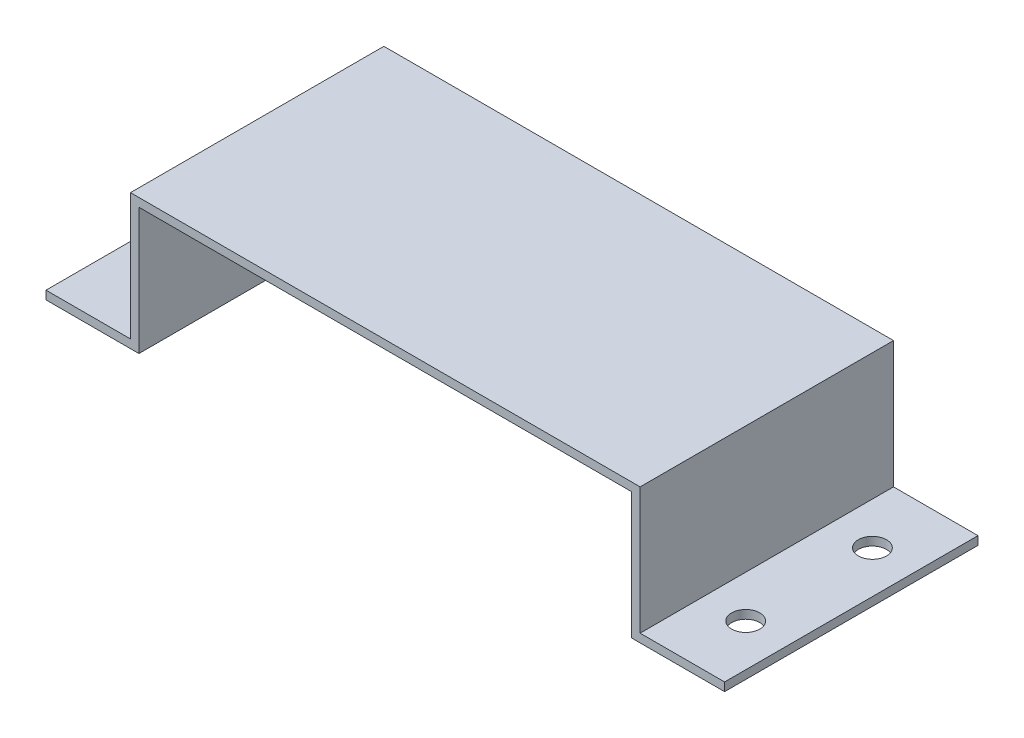
ISO-10303-21;
HEADER;
FILE_DESCRIPTION(('STEP AP214'),'2;1');
FILE_NAME('part.step','',(''),(''),'','','');
FILE_SCHEMA(('AUTOMOTIVE_DESIGN { 1 0 10303 214 1 1 1 1 }'));
ENDSEC;
DATA;
#1=APPLICATION_CONTEXT('core data for automotive mechanical design processes');
#2=APPLICATION_PROTOCOL_DEFINITION('international standard','automotive_design',2000,#1);
#3=PRODUCT_CONTEXT('',#1,'mechanical');
#4=PRODUCT('Part','Part','',(#3));
#5=PRODUCT_RELATED_PRODUCT_CATEGORY('part','',(#4));
#6=PRODUCT_DEFINITION_FORMATION('','',#4);
#7=PRODUCT_DEFINITION_CONTEXT('part definition',#1,'design');
#8=PRODUCT_DEFINITION('design','',#6,#7);
#9=PRODUCT_DEFINITION_SHAPE('','',#8);
#10=(LENGTH_UNIT() NAMED_UNIT(*) SI_UNIT(.MILLI.,.METRE.));
#11=(NAMED_UNIT(*) PLANE_ANGLE_UNIT() SI_UNIT($,.RADIAN.));
#12=(NAMED_UNIT(*) SI_UNIT($,.STERADIAN.) SOLID_ANGLE_UNIT());
#13=UNCERTAINTY_MEASURE_WITH_UNIT(LENGTH_MEASURE(1.E-05),#10,'distance_accuracy_value','');
#14=(GEOMETRIC_REPRESENTATION_CONTEXT(3) GLOBAL_UNCERTAINTY_ASSIGNED_CONTEXT((#13)) GLOBAL_UNIT_ASSIGNED_CONTEXT((#10,
#11,#12)) REPRESENTATION_CONTEXT('',''));
#15=CARTESIAN_POINT('',(0.,0.,0.));
#16=DIRECTION('',(0.,0.,1.));
#17=DIRECTION('',(1.,0.,0.));
#18=AXIS2_PLACEMENT_3D('',#15,#16,#17);
#19=CARTESIAN_POINT('',(159.03265048703,-21.5756520842586,90.));
#20=DIRECTION('',(0.,1.,0.));
#21=DIRECTION('',(0.,0.,1.));
#22=AXIS2_PLACEMENT_3D('',#19,#20,#21);
#23=PLANE('',#22);
#24=CARTESIAN_POINT('',(144.03265048703,-21.5756520842586,22.5));
#25=DIRECTION('',(0.,1.,0.));
#26=DIRECTION('',(0.,0.,1.));
#27=AXIS2_PLACEMENT_3D('',#24,#25,#26);
#28=CIRCLE('',#27,4.99999999999999);
#29=CARTESIAN_POINT('',(144.03265048703,-21.5756520842586,27.5));
#30=VERTEX_POINT('',#29);
#31=EDGE_CURVE('E216',#30,#30,#28,.T.);
#32=ORIENTED_EDGE('',*,*,#31,.T.);
#33=EDGE_LOOP('',(#32));
#34=FACE_BOUND('',#33,.T.);
#35=DIRECTION('',(1.,0.,0.));
#36=VECTOR('',#35,1.);
#37=CARTESIAN_POINT('',(159.03265048703,-21.5756520842586,0.));
#38=LINE('',#37,#36);
#39=CARTESIAN_POINT('',(126.03265048703,-21.5756520842586,0.));
#40=VERTEX_POINT('',#39);
#41=CARTESIAN_POINT('',(159.03265048703,-21.5756520842586,0.));
#42=VERTEX_POINT('',#41);
#43=EDGE_CURVE('E171',#40,#42,#38,.T.);
#44=ORIENTED_EDGE('',*,*,#43,.T.);
#45=DIRECTION('',(0.,0.,-1.));
#46=VECTOR('',#45,1.);
#47=CARTESIAN_POINT('',(159.03265048703,-21.5756520842586,90.));
#48=LINE('',#47,#46);
#49=CARTESIAN_POINT('',(159.03265048703,-21.5756520842586,90.));
#50=VERTEX_POINT('',#49);
#51=EDGE_CURVE('E203',#50,#42,#48,.T.);
#52=ORIENTED_EDGE('',*,*,#51,.F.);
#53=DIRECTION('',(1.,0.,0.));
#54=VECTOR('',#53,1.);
#55=CARTESIAN_POINT('',(126.03265048703,-21.5756520842586,90.));
#56=LINE('',#55,#54);
#57=CARTESIAN_POINT('',(126.03265048703,-21.5756520842586,90.));
#58=VERTEX_POINT('',#57);
#59=EDGE_CURVE('E237',#58,#50,#56,.T.);
#60=ORIENTED_EDGE('',*,*,#59,.F.);
#61=DIRECTION('',(0.,0.,-1.));
#62=VECTOR('',#61,1.);
#63=CARTESIAN_POINT('',(126.03265048703,-21.5756520842586,90.));
#64=LINE('',#63,#62);
#65=EDGE_CURVE('E206',#58,#40,#64,.T.);
#66=ORIENTED_EDGE('',*,*,#65,.T.);
#67=EDGE_LOOP('',(#44,#52,#60,#66));
#68=FACE_BOUND('',#67,.T.);
#69=CARTESIAN_POINT('',(144.03265048703,-21.5756520842586,67.5));
#70=DIRECTION('',(0.,1.,0.));
#71=DIRECTION('',(0.,0.,1.));
#72=AXIS2_PLACEMENT_3D('',#69,#70,#71);
#73=CIRCLE('',#72,4.99999999999999);
#74=CARTESIAN_POINT('',(144.03265048703,-21.5756520842586,72.5));
#75=VERTEX_POINT('',#74);
#76=EDGE_CURVE('E166',#75,#75,#73,.F.);
#77=ORIENTED_EDGE('',*,*,#76,.F.);
#78=EDGE_LOOP('',(#77));
#79=FACE_BOUND('',#78,.T.);
#80=ADVANCED_FACE('F37',(#34,#68,#79),#23,.F.);
#81=CARTESIAN_POINT('',(129.03265048703,-18.5756520842586,90.));
#82=DIRECTION('',(0.,-1.,0.));
#83=DIRECTION('',(0.,0.,-1.));
#84=AXIS2_PLACEMENT_3D('',#81,#82,#83);
#85=PLANE('',#84);
#86=CARTESIAN_POINT('',(144.03265048703,-18.5756520842586,22.5));
#87=DIRECTION('',(0.,1.,0.));
#88=DIRECTION('',(0.,0.,1.));
#89=AXIS2_PLACEMENT_3D('',#86,#87,#88);
#90=CIRCLE('',#89,4.99999999999999);
#91=CARTESIAN_POINT('',(144.03265048703,-18.5756520842586,27.5));
#92=VERTEX_POINT('',#91);
#93=EDGE_CURVE('E212',#92,#92,#90,.T.);
#94=ORIENTED_EDGE('',*,*,#93,.F.);
#95=EDGE_LOOP('',(#94));
#96=FACE_BOUND('',#95,.T.);
#97=DIRECTION('',(-1.,0.,0.));
#98=VECTOR('',#97,1.);
#99=CARTESIAN_POINT('',(129.03265048703,-18.5756520842586,0.));
#100=LINE('',#99,#98);
#101=CARTESIAN_POINT('',(159.03265048703,-18.5756520842586,0.));
#102=VERTEX_POINT('',#101);
#103=CARTESIAN_POINT('',(129.03265048703,-18.5756520842586,0.));
#104=VERTEX_POINT('',#103);
#105=EDGE_CURVE('E175',#102,#104,#100,.T.);
#106=ORIENTED_EDGE('',*,*,#105,.T.);
#107=DIRECTION('',(0.,0.,-1.));
#108=VECTOR('',#107,1.);
#109=CARTESIAN_POINT('',(129.03265048703,-18.5756520842586,90.));
#110=LINE('',#109,#108);
#111=CARTESIAN_POINT('',(129.03265048703,-18.5756520842586,90.));
#112=VERTEX_POINT('',#111);
#113=EDGE_CURVE('E197',#112,#104,#110,.T.);
#114=ORIENTED_EDGE('',*,*,#113,.F.);
#115=DIRECTION('',(-1.,0.,0.));
#116=VECTOR('',#115,1.);
#117=CARTESIAN_POINT('',(129.03265048703,-18.5756520842586,90.));
#118=LINE('',#117,#116);
#119=CARTESIAN_POINT('',(159.03265048703,-18.5756520842586,90.));
#120=VERTEX_POINT('',#119);
#121=EDGE_CURVE('E241',#120,#112,#118,.T.);
#122=ORIENTED_EDGE('',*,*,#121,.F.);
#123=DIRECTION('',(0.,0.,-1.));
#124=VECTOR('',#123,1.);
#125=CARTESIAN_POINT('',(159.03265048703,-18.5756520842586,90.));
#126=LINE('',#125,#124);
#127=EDGE_CURVE('E200',#120,#102,#126,.T.);
#128=ORIENTED_EDGE('',*,*,#127,.T.);
#129=EDGE_LOOP('',(#106,#114,#122,#128));
#130=FACE_BOUND('',#129,.T.);
#131=CARTESIAN_POINT('',(144.03265048703,-18.5756520842586,67.5));
#132=DIRECTION('',(0.,1.,0.));
#133=DIRECTION('',(0.,0.,1.));
#134=AXIS2_PLACEMENT_3D('',#131,#132,#133);
#135=CIRCLE('',#134,4.99999999999999);
#136=CARTESIAN_POINT('',(144.03265048703,-18.5756520842586,72.5));
#137=VERTEX_POINT('',#136);
#138=EDGE_CURVE('E218',#137,#137,#135,.F.);
#139=ORIENTED_EDGE('',*,*,#138,.T.);
#140=EDGE_LOOP('',(#139));
#141=FACE_BOUND('',#140,.T.);
#142=ADVANCED_FACE('F281',(#96,#130,#141),#85,.F.);
#143=CARTESIAN_POINT('',(-51.9673495129696,-18.5756520842586,90.));
#144=DIRECTION('',(0.,-1.,0.));
#145=DIRECTION('',(1.,0.,0.));
#146=AXIS2_PLACEMENT_3D('',#143,#144,#145);
#147=PLANE('',#146);
#148=CARTESIAN_POINT('',(-66.9673495129696,-18.5756520842586,67.5));
#149=DIRECTION('',(0.,1.,0.));
#150=DIRECTION('',(0.,0.,1.));
#151=AXIS2_PLACEMENT_3D('',#148,#149,#150);
#152=CIRCLE('',#151,4.99999999999999);
#153=CARTESIAN_POINT('',(-66.9673495129696,-18.5756520842586,72.5));
#154=VERTEX_POINT('',#153);
#155=EDGE_CURVE('E223',#154,#154,#152,.T.);
#156=ORIENTED_EDGE('',*,*,#155,.F.);
#157=EDGE_LOOP('',(#156));
#158=FACE_BOUND('',#157,.T.);
#159=DIRECTION('',(-1.,0.,0.));
#160=VECTOR('',#159,1.);
#161=CARTESIAN_POINT('',(-51.9673495129696,-18.5756520842586,0.));
#162=LINE('',#161,#160);
#163=CARTESIAN_POINT('',(-51.9673495129696,-18.5756520842586,0.));
#164=VERTEX_POINT('',#163);
#165=CARTESIAN_POINT('',(-81.9673495129696,-18.5756520842586,0.));
#166=VERTEX_POINT('',#165);
#167=EDGE_CURVE('E151',#164,#166,#162,.T.);
#168=ORIENTED_EDGE('',*,*,#167,.T.);
#169=DIRECTION('',(0.,0.,-1.));
#170=VECTOR('',#169,1.);
#171=CARTESIAN_POINT('',(-81.9673495129696,-18.5756520842586,90.));
#172=LINE('',#171,#170);
#173=CARTESIAN_POINT('',(-81.9673495129696,-18.5756520842586,90.));
#174=VERTEX_POINT('',#173);
#175=EDGE_CURVE('E147',#174,#166,#172,.T.);
#176=ORIENTED_EDGE('',*,*,#175,.F.);
#177=DIRECTION('',(-1.,0.,0.));
#178=VECTOR('',#177,1.);
#179=CARTESIAN_POINT('',(-51.9673495129696,-18.5756520842586,90.));
#180=LINE('',#179,#178);
#181=CARTESIAN_POINT('',(-51.9673495129696,-18.5756520842586,90.));
#182=VERTEX_POINT('',#181);
#183=EDGE_CURVE('E134',#182,#174,#180,.T.);
#184=ORIENTED_EDGE('',*,*,#183,.F.);
#185=DIRECTION('',(0.,0.,-1.));
#186=VECTOR('',#185,1.);
#187=CARTESIAN_POINT('',(-51.9673495129696,-18.5756520842586,90.));
#188=LINE('',#187,#186);
#189=EDGE_CURVE('E153',#182,#164,#188,.T.);
#190=ORIENTED_EDGE('',*,*,#189,.T.);
#191=EDGE_LOOP('',(#168,#176,#184,#190));
#192=FACE_BOUND('',#191,.T.);
#193=CARTESIAN_POINT('',(-66.9673495129696,-18.5756520842586,22.5));
#194=DIRECTION('',(0.,1.,0.));
#195=DIRECTION('',(0.,0.,1.));
#196=AXIS2_PLACEMENT_3D('',#193,#194,#195);
#197=CIRCLE('',#196,4.99999999999999);
#198=CARTESIAN_POINT('',(-66.9673495129696,-18.5756520842586,27.5));
#199=VERTEX_POINT('',#198);
#200=EDGE_CURVE('E227',#199,#199,#197,.F.);
#201=ORIENTED_EDGE('',*,*,#200,.T.);
#202=EDGE_LOOP('',(#201));
#203=FACE_BOUND('',#202,.T.);
#204=ADVANCED_FACE('F148',(#158,#192,#203),#147,.F.);
#205=CARTESIAN_POINT('',(-48.9673495129696,-21.5756520842586,90.));
#206=DIRECTION('',(0.,1.,0.));
#207=DIRECTION('',(0.,0.,1.));
#208=AXIS2_PLACEMENT_3D('',#205,#206,#207);
#209=PLANE('',#208);
#210=CARTESIAN_POINT('',(-66.9673495129696,-21.5756520842586,67.5));
#211=DIRECTION('',(0.,1.,0.));
#212=DIRECTION('',(0.,0.,1.));
#213=AXIS2_PLACEMENT_3D('',#210,#211,#212);
#214=CIRCLE('',#213,4.99999999999999);
#215=CARTESIAN_POINT('',(-66.9673495129696,-21.5756520842586,72.5));
#216=VERTEX_POINT('',#215);
#217=EDGE_CURVE('E210',#216,#216,#214,.T.);
#218=ORIENTED_EDGE('',*,*,#217,.T.);
#219=EDGE_LOOP('',(#218));
#220=FACE_BOUND('',#219,.T.);
#221=DIRECTION('',(1.,0.,0.));
#222=VECTOR('',#221,1.);
#223=CARTESIAN_POINT('',(-48.9673495129696,-21.5756520842586,0.));
#224=LINE('',#223,#222);
#225=CARTESIAN_POINT('',(-81.9673495129696,-21.5756520842586,0.));
#226=VERTEX_POINT('',#225);
#227=CARTESIAN_POINT('',(-48.9673495129696,-21.5756520842586,0.));
#228=VERTEX_POINT('',#227);
#229=EDGE_CURVE('E97',#226,#228,#224,.T.);
#230=ORIENTED_EDGE('',*,*,#229,.T.);
#231=DIRECTION('',(0.,0.,-1.));
#232=VECTOR('',#231,1.);
#233=CARTESIAN_POINT('',(-48.9673495129696,-21.5756520842586,90.));
#234=LINE('',#233,#232);
#235=CARTESIAN_POINT('',(-48.9673495129696,-21.5756520842586,90.));
#236=VERTEX_POINT('',#235);
#237=EDGE_CURVE('E158',#236,#228,#234,.T.);
#238=ORIENTED_EDGE('',*,*,#237,.F.);
#239=DIRECTION('',(1.,0.,0.));
#240=VECTOR('',#239,1.);
#241=CARTESIAN_POINT('',(-81.9673495129696,-21.5756520842586,90.));
#242=LINE('',#241,#240);
#243=CARTESIAN_POINT('',(-81.9673495129696,-21.5756520842586,90.));
#244=VERTEX_POINT('',#243);
#245=EDGE_CURVE('E56',#244,#236,#242,.T.);
#246=ORIENTED_EDGE('',*,*,#245,.F.);
#247=DIRECTION('',(0.,0.,-1.));
#248=VECTOR('',#247,1.);
#249=CARTESIAN_POINT('',(-81.9673495129696,-21.5756520842586,90.));
#250=LINE('',#249,#248);
#251=EDGE_CURVE('E154',#244,#226,#250,.T.);
#252=ORIENTED_EDGE('',*,*,#251,.T.);
#253=EDGE_LOOP('',(#230,#238,#246,#252));
#254=FACE_BOUND('',#253,.T.);
#255=CARTESIAN_POINT('',(-66.9673495129696,-21.5756520842586,22.5));
#256=DIRECTION('',(0.,1.,0.));
#257=DIRECTION('',(0.,0.,1.));
#258=AXIS2_PLACEMENT_3D('',#255,#256,#257);
#259=CIRCLE('',#258,4.99999999999999);
#260=CARTESIAN_POINT('',(-66.9673495129696,-21.5756520842586,27.5));
#261=VERTEX_POINT('',#260);
#262=EDGE_CURVE('E41',#261,#261,#259,.F.);
#263=ORIENTED_EDGE('',*,*,#262,.F.);
#264=EDGE_LOOP('',(#263));
#265=FACE_BOUND('',#264,.T.);
#266=ADVANCED_FACE('F257',(#220,#254,#265),#209,.F.);
#267=CARTESIAN_POINT('',(-48.9673495129696,23.4243479157414,90.));
#268=DIRECTION('',(-1.,0.,0.));
#269=DIRECTION('',(0.,-1.,0.));
#270=AXIS2_PLACEMENT_3D('',#267,#268,#269);
#271=PLANE('',#270);
#272=DIRECTION('',(0.,1.,0.));
#273=VECTOR('',#272,1.);
#274=CARTESIAN_POINT('',(-48.9673495129696,23.4243479157414,0.));
#275=LINE('',#274,#273);
#276=CARTESIAN_POINT('',(-48.9673495129696,23.4243479157414,0.));
#277=VERTEX_POINT('',#276);
#278=EDGE_CURVE('E162',#228,#277,#275,.T.);
#279=ORIENTED_EDGE('',*,*,#278,.T.);
#280=DIRECTION('',(0.,0.,-1.));
#281=VECTOR('',#280,1.);
#282=CARTESIAN_POINT('',(-48.9673495129696,23.4243479157414,90.));
#283=LINE('',#282,#281);
#284=CARTESIAN_POINT('',(-48.9673495129696,23.4243479157414,90.));
#285=VERTEX_POINT('',#284);
#286=EDGE_CURVE('E11',#285,#277,#283,.T.);
#287=ORIENTED_EDGE('',*,*,#286,.F.);
#288=DIRECTION('',(0.,1.,0.));
#289=VECTOR('',#288,1.);
#290=CARTESIAN_POINT('',(-48.9673495129696,23.4243479157414,90.));
#291=LINE('',#290,#289);
#292=EDGE_CURVE('E187',#236,#285,#291,.T.);
#293=ORIENTED_EDGE('',*,*,#292,.F.);
#294=ORIENTED_EDGE('',*,*,#237,.T.);
#295=EDGE_LOOP('',(#279,#287,#293,#294));
#296=FACE_BOUND('',#295,.T.);
#297=ADVANCED_FACE('F39',(#296),#271,.F.);
#298=CARTESIAN_POINT('',(-48.9673495129696,23.4243479157414,90.));
#299=DIRECTION('',(0.,1.,0.));
#300=DIRECTION('',(0.,0.,1.));
#301=AXIS2_PLACEMENT_3D('',#298,#299,#300);
#302=PLANE('',#301);
#303=DIRECTION('',(1.,0.,0.));
#304=VECTOR('',#303,1.);
#305=CARTESIAN_POINT('',(-48.9673495129696,23.4243479157414,0.));
#306=LINE('',#305,#304);
#307=CARTESIAN_POINT('',(126.03265048703,23.4243479157414,0.));
#308=VERTEX_POINT('',#307);
#309=EDGE_CURVE('E165',#277,#308,#306,.T.);
#310=ORIENTED_EDGE('',*,*,#309,.T.);
#311=DIRECTION('',(0.,0.,-1.));
#312=VECTOR('',#311,1.);
#313=CARTESIAN_POINT('',(126.03265048703,23.4243479157414,90.));
#314=LINE('',#313,#312);
#315=CARTESIAN_POINT('',(126.03265048703,23.4243479157414,90.));
#316=VERTEX_POINT('',#315);
#317=EDGE_CURVE('E47',#316,#308,#314,.T.);
#318=ORIENTED_EDGE('',*,*,#317,.F.);
#319=DIRECTION('',(1.,0.,0.));
#320=VECTOR('',#319,1.);
#321=CARTESIAN_POINT('',(-48.9673495129696,23.4243479157414,90.));
#322=LINE('',#321,#320);
#323=EDGE_CURVE('E109',#285,#316,#322,.T.);
#324=ORIENTED_EDGE('',*,*,#323,.F.);
#325=ORIENTED_EDGE('',*,*,#286,.T.);
#326=EDGE_LOOP('',(#310,#318,#324,#325));
#327=FACE_BOUND('',#326,.T.);
#328=ADVANCED_FACE('F264',(#327),#302,.F.);
#329=CARTESIAN_POINT('',(126.03265048703,23.4243479157414,90.));
#330=DIRECTION('',(1.,0.,0.));
#331=DIRECTION('',(0.,0.,-1.));
#332=AXIS2_PLACEMENT_3D('',#329,#330,#331);
#333=PLANE('',#332);
#334=DIRECTION('',(0.,-1.,0.));
#335=VECTOR('',#334,1.);
#336=CARTESIAN_POINT('',(126.03265048703,23.4243479157414,0.));
#337=LINE('',#336,#335);
#338=EDGE_CURVE('E168',#308,#40,#337,.T.);
#339=ORIENTED_EDGE('',*,*,#338,.T.);
#340=ORIENTED_EDGE('',*,*,#65,.F.);
#341=DIRECTION('',(0.,-1.,0.));
#342=VECTOR('',#341,1.);
#343=CARTESIAN_POINT('',(126.03265048703,23.4243479157414,90.));
#344=LINE('',#343,#342);
#345=EDGE_CURVE('E235',#316,#58,#344,.T.);
#346=ORIENTED_EDGE('',*,*,#345,.F.);
#347=ORIENTED_EDGE('',*,*,#317,.T.);
#348=EDGE_LOOP('',(#339,#340,#346,#347));
#349=FACE_BOUND('',#348,.T.);
#350=ADVANCED_FACE('F267',(#349),#333,.F.);
#351=CARTESIAN_POINT('',(159.03265048703,-18.5756520842586,90.));
#352=DIRECTION('',(-1.,0.,0.));
#353=DIRECTION('',(0.,0.,1.));
#354=AXIS2_PLACEMENT_3D('',#351,#352,#353);
#355=PLANE('',#354);
#356=DIRECTION('',(0.,1.,0.));
#357=VECTOR('',#356,1.);
#358=CARTESIAN_POINT('',(159.03265048703,-18.5756520842586,0.));
#359=LINE('',#358,#357);
#360=EDGE_CURVE('E173',#42,#102,#359,.T.);
#361=ORIENTED_EDGE('',*,*,#360,.T.);
#362=ORIENTED_EDGE('',*,*,#127,.F.);
#363=DIRECTION('',(0.,1.,0.));
#364=VECTOR('',#363,1.);
#365=CARTESIAN_POINT('',(159.03265048703,-18.5756520842586,90.));
#366=LINE('',#365,#364);
#367=EDGE_CURVE('E239',#50,#120,#366,.T.);
#368=ORIENTED_EDGE('',*,*,#367,.F.);
#369=ORIENTED_EDGE('',*,*,#51,.T.);
#370=EDGE_LOOP('',(#361,#362,#368,#369));
#371=FACE_BOUND('',#370,.T.);
#372=ADVANCED_FACE('F277',(#371),#355,.F.);
#373=CARTESIAN_POINT('',(129.03265048703,26.4243479157414,90.));
#374=DIRECTION('',(-1.,0.,0.));
#375=DIRECTION('',(0.,0.,1.));
#376=AXIS2_PLACEMENT_3D('',#373,#374,#375);
#377=PLANE('',#376);
#378=DIRECTION('',(0.,1.,0.));
#379=VECTOR('',#378,1.);
#380=CARTESIAN_POINT('',(129.03265048703,26.4243479157414,0.));
#381=LINE('',#380,#379);
#382=CARTESIAN_POINT('',(129.03265048703,26.4243479157414,0.));
#383=VERTEX_POINT('',#382);
#384=EDGE_CURVE('E177',#104,#383,#381,.T.);
#385=ORIENTED_EDGE('',*,*,#384,.T.);
#386=DIRECTION('',(0.,0.,-1.));
#387=VECTOR('',#386,1.);
#388=CARTESIAN_POINT('',(129.03265048703,26.4243479157414,90.));
#389=LINE('',#388,#387);
#390=CARTESIAN_POINT('',(129.03265048703,26.4243479157414,90.));
#391=VERTEX_POINT('',#390);
#392=EDGE_CURVE('E194',#391,#383,#389,.T.);
#393=ORIENTED_EDGE('',*,*,#392,.F.);
#394=DIRECTION('',(0.,1.,0.));
#395=VECTOR('',#394,1.);
#396=CARTESIAN_POINT('',(129.03265048703,26.4243479157414,90.));
#397=LINE('',#396,#395);
#398=EDGE_CURVE('E243',#112,#391,#397,.T.);
#399=ORIENTED_EDGE('',*,*,#398,.F.);
#400=ORIENTED_EDGE('',*,*,#113,.T.);
#401=EDGE_LOOP('',(#385,#393,#399,#400));
#402=FACE_BOUND('',#401,.T.);
#403=ADVANCED_FACE('F285',(#402),#377,.F.);
#404=CARTESIAN_POINT('',(-51.9673495129696,26.4243479157414,90.));
#405=DIRECTION('',(0.,-1.,0.));
#406=DIRECTION('',(0.,0.,-1.));
#407=AXIS2_PLACEMENT_3D('',#404,#405,#406);
#408=PLANE('',#407);
#409=DIRECTION('',(-1.,0.,0.));
#410=VECTOR('',#409,1.);
#411=CARTESIAN_POINT('',(-51.9673495129696,26.4243479157414,0.));
#412=LINE('',#411,#410);
#413=CARTESIAN_POINT('',(-51.9673495129696,26.4243479157414,0.));
#414=VERTEX_POINT('',#413);
#415=EDGE_CURVE('E179',#383,#414,#412,.T.);
#416=ORIENTED_EDGE('',*,*,#415,.T.);
#417=DIRECTION('',(0.,0.,-1.));
#418=VECTOR('',#417,1.);
#419=CARTESIAN_POINT('',(-51.9673495129696,26.4243479157414,90.));
#420=LINE('',#419,#418);
#421=CARTESIAN_POINT('',(-51.9673495129696,26.4243479157414,90.));
#422=VERTEX_POINT('',#421);
#423=EDGE_CURVE('E191',#422,#414,#420,.T.);
#424=ORIENTED_EDGE('',*,*,#423,.F.);
#425=DIRECTION('',(-1.,0.,0.));
#426=VECTOR('',#425,1.);
#427=CARTESIAN_POINT('',(-51.9673495129696,26.4243479157414,90.));
#428=LINE('',#427,#426);
#429=EDGE_CURVE('E245',#391,#422,#428,.T.);
#430=ORIENTED_EDGE('',*,*,#429,.F.);
#431=ORIENTED_EDGE('',*,*,#392,.T.);
#432=EDGE_LOOP('',(#416,#424,#430,#431));
#433=FACE_BOUND('',#432,.T.);
#434=ADVANCED_FACE('F251',(#433),#408,.F.);
#435=CARTESIAN_POINT('',(-51.9673495129696,26.4243479157414,90.));
#436=DIRECTION('',(1.,0.,0.));
#437=DIRECTION('',(0.,0.,-1.));
#438=AXIS2_PLACEMENT_3D('',#435,#436,#437);
#439=PLANE('',#438);
#440=DIRECTION('',(0.,-1.,0.));
#441=VECTOR('',#440,1.);
#442=CARTESIAN_POINT('',(-51.9673495129696,26.4243479157414,0.));
#443=LINE('',#442,#441);
#444=EDGE_CURVE('E181',#414,#164,#443,.T.);
#445=ORIENTED_EDGE('',*,*,#444,.T.);
#446=ORIENTED_EDGE('',*,*,#189,.F.);
#447=DIRECTION('',(0.,-1.,0.));
#448=VECTOR('',#447,1.);
#449=CARTESIAN_POINT('',(-51.9673495129696,26.4243479157414,90.));
#450=LINE('',#449,#448);
#451=EDGE_CURVE('E141',#422,#182,#450,.T.);
#452=ORIENTED_EDGE('',*,*,#451,.F.);
#453=ORIENTED_EDGE('',*,*,#423,.T.);
#454=EDGE_LOOP('',(#445,#446,#452,#453));
#455=FACE_BOUND('',#454,.T.);
#456=ADVANCED_FACE('F255',(#455),#439,.F.);
#457=CARTESIAN_POINT('',(-81.9673495129696,-18.5756520842586,90.));
#458=DIRECTION('',(1.,0.,0.));
#459=DIRECTION('',(0.,0.,-1.));
#460=AXIS2_PLACEMENT_3D('',#457,#458,#459);
#461=PLANE('',#460);
#462=DIRECTION('',(0.,-1.,0.));
#463=VECTOR('',#462,1.);
#464=CARTESIAN_POINT('',(-81.9673495129696,-18.5756520842586,0.));
#465=LINE('',#464,#463);
#466=EDGE_CURVE('E184',#166,#226,#465,.T.);
#467=ORIENTED_EDGE('',*,*,#466,.T.);
#468=ORIENTED_EDGE('',*,*,#251,.F.);
#469=DIRECTION('',(0.,-1.,0.));
#470=VECTOR('',#469,1.);
#471=CARTESIAN_POINT('',(-81.9673495129696,-18.5756520842586,90.));
#472=LINE('',#471,#470);
#473=EDGE_CURVE('E138',#174,#244,#472,.T.);
#474=ORIENTED_EDGE('',*,*,#473,.F.);
#475=ORIENTED_EDGE('',*,*,#175,.T.);
#476=EDGE_LOOP('',(#467,#468,#474,#475));
#477=FACE_BOUND('',#476,.T.);
#478=ADVANCED_FACE('F156',(#477),#461,.F.);
#479=CARTESIAN_POINT('',(0.,0.,90.));
#480=DIRECTION('',(0.,0.,-1.));
#481=DIRECTION('',(-1.,0.,0.));
#482=AXIS2_PLACEMENT_3D('',#479,#480,#481);
#483=PLANE('',#482);
#484=ORIENTED_EDGE('',*,*,#292,.T.);
#485=ORIENTED_EDGE('',*,*,#323,.T.);
#486=ORIENTED_EDGE('',*,*,#345,.T.);
#487=ORIENTED_EDGE('',*,*,#59,.T.);
#488=ORIENTED_EDGE('',*,*,#367,.T.);
#489=ORIENTED_EDGE('',*,*,#121,.T.);
#490=ORIENTED_EDGE('',*,*,#398,.T.);
#491=ORIENTED_EDGE('',*,*,#429,.T.);
#492=ORIENTED_EDGE('',*,*,#451,.T.);
#493=ORIENTED_EDGE('',*,*,#183,.T.);
#494=ORIENTED_EDGE('',*,*,#473,.T.);
#495=ORIENTED_EDGE('',*,*,#245,.T.);
#496=EDGE_LOOP('',(#484,#485,#486,#487,#488,#489,#490,#491,#492,#493,#494,#495));
#497=FACE_BOUND('',#496,.T.);
#498=ADVANCED_FACE('F136',(#497),#483,.F.);
#499=CARTESIAN_POINT('',(0.,0.,0.));
#500=DIRECTION('',(0.,0.,-1.));
#501=DIRECTION('',(-1.,0.,0.));
#502=AXIS2_PLACEMENT_3D('',#499,#500,#501);
#503=PLANE('',#502);
#504=ORIENTED_EDGE('',*,*,#278,.F.);
#505=ORIENTED_EDGE('',*,*,#229,.F.);
#506=ORIENTED_EDGE('',*,*,#466,.F.);
#507=ORIENTED_EDGE('',*,*,#167,.F.);
#508=ORIENTED_EDGE('',*,*,#444,.F.);
#509=ORIENTED_EDGE('',*,*,#415,.F.);
#510=ORIENTED_EDGE('',*,*,#384,.F.);
#511=ORIENTED_EDGE('',*,*,#105,.F.);
#512=ORIENTED_EDGE('',*,*,#360,.F.);
#513=ORIENTED_EDGE('',*,*,#43,.F.);
#514=ORIENTED_EDGE('',*,*,#338,.F.);
#515=ORIENTED_EDGE('',*,*,#309,.F.);
#516=EDGE_LOOP('',(#504,#505,#506,#507,#508,#509,#510,#511,#512,#513,#514,#515));
#517=FACE_BOUND('',#516,.T.);
#518=ADVANCED_FACE('F256',(#517),#503,.T.);
#519=CARTESIAN_POINT('',(-66.9673495129696,-108.575652084259,67.5));
#520=DIRECTION('',(0.,1.,0.));
#521=DIRECTION('',(0.,0.,1.));
#522=AXIS2_PLACEMENT_3D('',#519,#520,#521);
#523=CYLINDRICAL_SURFACE('',#522,4.99999999999999);
#524=ORIENTED_EDGE('',*,*,#155,.T.);
#525=EDGE_LOOP('',(#524));
#526=FACE_BOUND('',#525,.T.);
#527=ORIENTED_EDGE('',*,*,#217,.F.);
#528=EDGE_LOOP('',(#527));
#529=FACE_BOUND('',#528,.T.);
#530=ADVANCED_FACE('F342',(#526,#529),#523,.F.);
#531=CARTESIAN_POINT('',(-66.9673495129696,-108.575652084259,22.5));
#532=DIRECTION('',(0.,1.,0.));
#533=DIRECTION('',(0.,0.,1.));
#534=AXIS2_PLACEMENT_3D('',#531,#532,#533);
#535=CYLINDRICAL_SURFACE('',#534,4.99999999999999);
#536=ORIENTED_EDGE('',*,*,#200,.F.);
#537=EDGE_LOOP('',(#536));
#538=FACE_BOUND('',#537,.T.);
#539=ORIENTED_EDGE('',*,*,#262,.T.);
#540=EDGE_LOOP('',(#539));
#541=FACE_BOUND('',#540,.T.);
#542=ADVANCED_FACE('F348',(#538,#541),#535,.F.);
#543=CARTESIAN_POINT('',(144.03265048703,-108.575652084259,22.5));
#544=DIRECTION('',(0.,1.,0.));
#545=DIRECTION('',(0.,0.,1.));
#546=AXIS2_PLACEMENT_3D('',#543,#544,#545);
#547=CYLINDRICAL_SURFACE('',#546,4.99999999999999);
#548=ORIENTED_EDGE('',*,*,#93,.T.);
#549=EDGE_LOOP('',(#548));
#550=FACE_BOUND('',#549,.T.);
#551=ORIENTED_EDGE('',*,*,#31,.F.);
#552=EDGE_LOOP('',(#551));
#553=FACE_BOUND('',#552,.T.);
#554=ADVANCED_FACE('F356',(#550,#553),#547,.F.);
#555=CARTESIAN_POINT('',(144.03265048703,-108.575652084259,67.5));
#556=DIRECTION('',(0.,1.,0.));
#557=DIRECTION('',(0.,0.,1.));
#558=AXIS2_PLACEMENT_3D('',#555,#556,#557);
#559=CYLINDRICAL_SURFACE('',#558,4.99999999999999);
#560=ORIENTED_EDGE('',*,*,#138,.F.);
#561=EDGE_LOOP('',(#560));
#562=FACE_BOUND('',#561,.T.);
#563=ORIENTED_EDGE('',*,*,#76,.T.);
#564=EDGE_LOOP('',(#563));
#565=FACE_BOUND('',#564,.T.);
#566=ADVANCED_FACE('F364',(#562,#565),#559,.F.);
#567=CLOSED_SHELL('',(#80,#142,#204,#266,#297,#328,#350,#372,#403,#434,#456,#478,#498,#518,#530,
#542,#554,#566));
#568=MANIFOLD_SOLID_BREP('B2',#567);
#569=ADVANCED_BREP_SHAPE_REPRESENTATION('',(#18,#568),#14);
#570=SHAPE_DEFINITION_REPRESENTATION(#9,#569);
ENDSEC;
END-ISO-10303-21;
